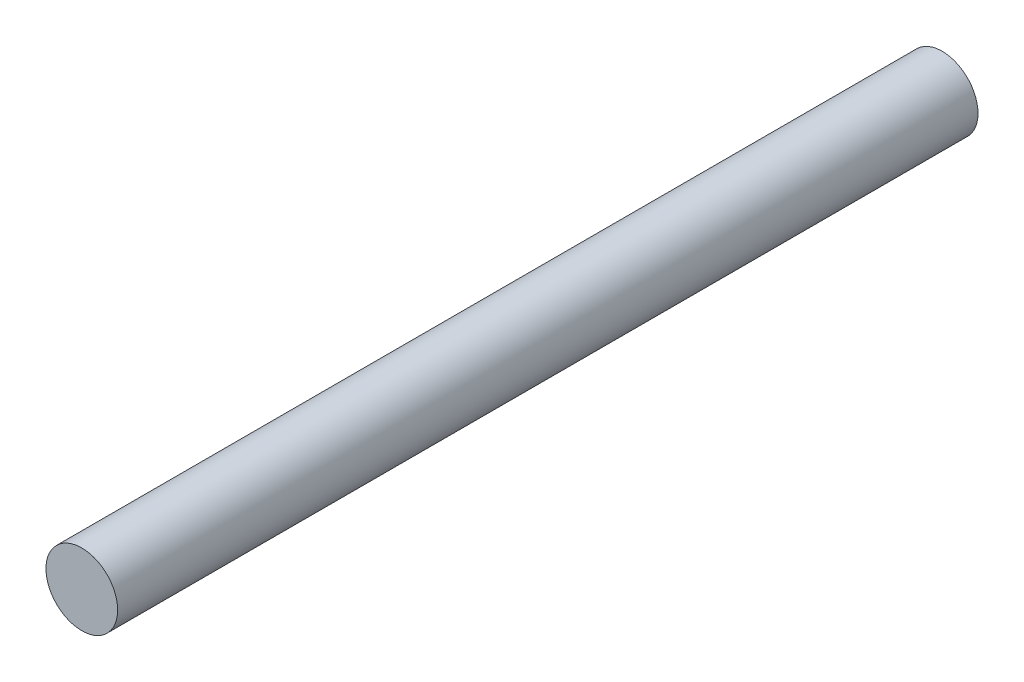
ISO-10303-21;
HEADER;
FILE_DESCRIPTION(('STEP AP214'),'2;1');
FILE_NAME('part.step','',(''),(''),'','','');
FILE_SCHEMA(('AUTOMOTIVE_DESIGN { 1 0 10303 214 1 1 1 1 }'));
ENDSEC;
DATA;
#1=APPLICATION_CONTEXT('core data for automotive mechanical design processes');
#2=APPLICATION_PROTOCOL_DEFINITION('international standard','automotive_design',2000,#1);
#3=PRODUCT_CONTEXT('',#1,'mechanical');
#4=PRODUCT('Part','Part','',(#3));
#5=PRODUCT_RELATED_PRODUCT_CATEGORY('part','',(#4));
#6=PRODUCT_DEFINITION_FORMATION('','',#4);
#7=PRODUCT_DEFINITION_CONTEXT('part definition',#1,'design');
#8=PRODUCT_DEFINITION('design','',#6,#7);
#9=PRODUCT_DEFINITION_SHAPE('','',#8);
#10=(LENGTH_UNIT() NAMED_UNIT(*) SI_UNIT(.MILLI.,.METRE.));
#11=(NAMED_UNIT(*) PLANE_ANGLE_UNIT() SI_UNIT($,.RADIAN.));
#12=(NAMED_UNIT(*) SI_UNIT($,.STERADIAN.) SOLID_ANGLE_UNIT());
#13=UNCERTAINTY_MEASURE_WITH_UNIT(LENGTH_MEASURE(1.E-05),#10,'distance_accuracy_value','');
#14=(GEOMETRIC_REPRESENTATION_CONTEXT(3) GLOBAL_UNCERTAINTY_ASSIGNED_CONTEXT((#13)) GLOBAL_UNIT_ASSIGNED_CONTEXT((#10,
#11,#12)) REPRESENTATION_CONTEXT('',''));
#15=CARTESIAN_POINT('',(0.,0.,0.));
#16=DIRECTION('',(0.,0.,1.));
#17=DIRECTION('',(1.,0.,0.));
#18=AXIS2_PLACEMENT_3D('',#15,#16,#17);
#19=CARTESIAN_POINT('',(0.,0.,60.));
#20=DIRECTION('',(0.,0.,-1.));
#21=DIRECTION('',(-1.,0.,0.));
#22=AXIS2_PLACEMENT_3D('',#19,#20,#21);
#23=CYLINDRICAL_SURFACE('',#22,2.5);
#24=CARTESIAN_POINT('',(0.,0.,60.));
#25=DIRECTION('',(0.,0.,1.));
#26=DIRECTION('',(1.,0.,0.));
#27=AXIS2_PLACEMENT_3D('',#24,#25,#26);
#28=CIRCLE('',#27,2.5);
#29=CARTESIAN_POINT('',(2.5,0.,60.));
#30=VERTEX_POINT('',#29);
#31=EDGE_CURVE('E10',#30,#30,#28,.T.);
#32=ORIENTED_EDGE('',*,*,#31,.F.);
#33=EDGE_LOOP('',(#32));
#34=FACE_BOUND('',#33,.T.);
#35=CARTESIAN_POINT('',(0.,0.,0.));
#36=DIRECTION('',(0.,0.,1.));
#37=DIRECTION('',(1.,0.,0.));
#38=AXIS2_PLACEMENT_3D('',#35,#36,#37);
#39=CIRCLE('',#38,2.5);
#40=CARTESIAN_POINT('',(2.5,0.,0.));
#41=VERTEX_POINT('',#40);
#42=EDGE_CURVE('E41',#41,#41,#39,.T.);
#43=ORIENTED_EDGE('',*,*,#42,.T.);
#44=EDGE_LOOP('',(#43));
#45=FACE_BOUND('',#44,.T.);
#46=ADVANCED_FACE('F38',(#34,#45),#23,.T.);
#47=CARTESIAN_POINT('',(0.,0.,60.));
#48=DIRECTION('',(0.,0.,1.));
#49=DIRECTION('',(1.,0.,0.));
#50=AXIS2_PLACEMENT_3D('',#47,#48,#49);
#51=PLANE('',#50);
#52=ORIENTED_EDGE('',*,*,#31,.T.);
#53=EDGE_LOOP('',(#52));
#54=FACE_BOUND('',#53,.T.);
#55=ADVANCED_FACE('F53',(#54),#51,.T.);
#56=CARTESIAN_POINT('',(0.,0.,0.));
#57=DIRECTION('',(0.,0.,1.));
#58=DIRECTION('',(1.,0.,0.));
#59=AXIS2_PLACEMENT_3D('',#56,#57,#58);
#60=PLANE('',#59);
#61=ORIENTED_EDGE('',*,*,#42,.F.);
#62=EDGE_LOOP('',(#61));
#63=FACE_BOUND('',#62,.T.);
#64=ADVANCED_FACE('F51',(#63),#60,.F.);
#65=CLOSED_SHELL('',(#46,#55,#64));
#66=MANIFOLD_SOLID_BREP('B2',#65);
#67=ADVANCED_BREP_SHAPE_REPRESENTATION('',(#18,#66),#14);
#68=SHAPE_DEFINITION_REPRESENTATION(#9,#67);
ENDSEC;
END-ISO-10303-21;
